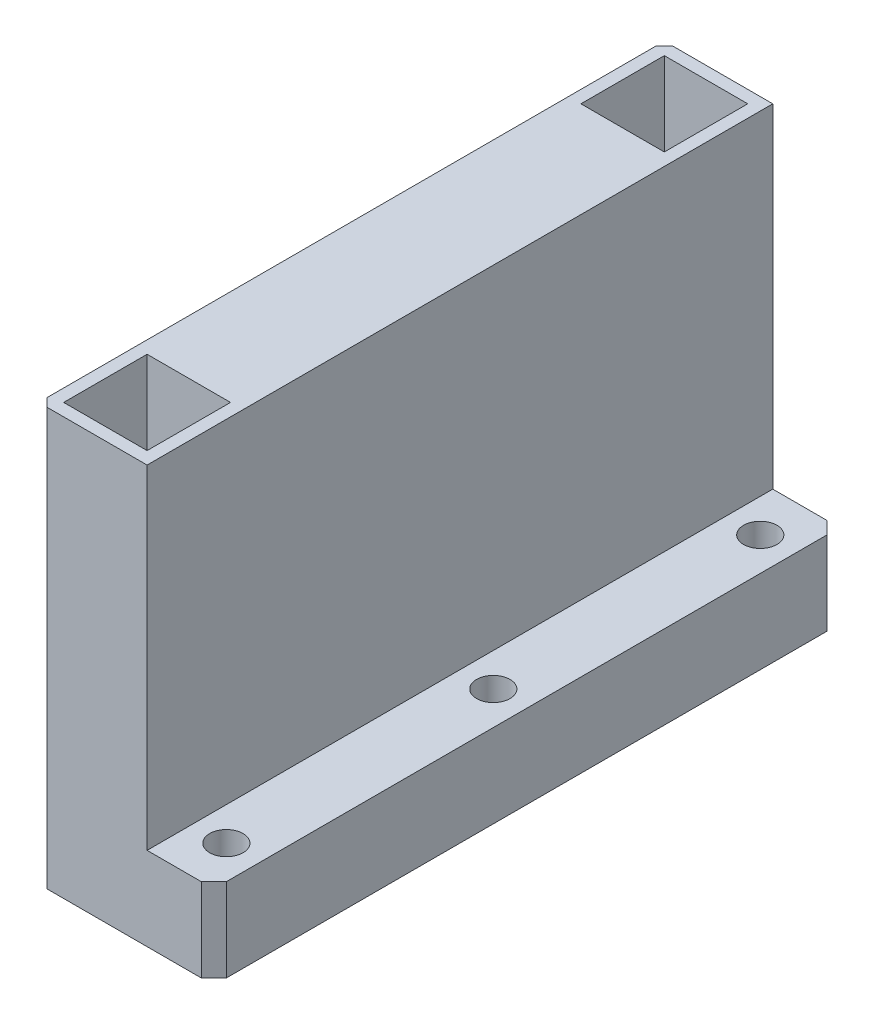
ISO-10303-21;
HEADER;
FILE_DESCRIPTION(('STEP AP214'),'2;1');
FILE_NAME('part.step','',(''),(''),'','','');
FILE_SCHEMA(('AUTOMOTIVE_DESIGN { 1 0 10303 214 1 1 1 1 }'));
ENDSEC;
DATA;
#1=APPLICATION_CONTEXT('core data for automotive mechanical design processes');
#2=APPLICATION_PROTOCOL_DEFINITION('international standard','automotive_design',2000,#1);
#3=PRODUCT_CONTEXT('',#1,'mechanical');
#4=PRODUCT('Part','Part','',(#3));
#5=PRODUCT_RELATED_PRODUCT_CATEGORY('part','',(#4));
#6=PRODUCT_DEFINITION_FORMATION('','',#4);
#7=PRODUCT_DEFINITION_CONTEXT('part definition',#1,'design');
#8=PRODUCT_DEFINITION('design','',#6,#7);
#9=PRODUCT_DEFINITION_SHAPE('','',#8);
#10=(LENGTH_UNIT() NAMED_UNIT(*) SI_UNIT(.MILLI.,.METRE.));
#11=(NAMED_UNIT(*) PLANE_ANGLE_UNIT() SI_UNIT($,.RADIAN.));
#12=(NAMED_UNIT(*) SI_UNIT($,.STERADIAN.) SOLID_ANGLE_UNIT());
#13=UNCERTAINTY_MEASURE_WITH_UNIT(LENGTH_MEASURE(1.E-05),#10,'distance_accuracy_value','');
#14=(GEOMETRIC_REPRESENTATION_CONTEXT(3) GLOBAL_UNCERTAINTY_ASSIGNED_CONTEXT((#13)) GLOBAL_UNIT_ASSIGNED_CONTEXT((#10,
#11,#12)) REPRESENTATION_CONTEXT('',''));
#15=CARTESIAN_POINT('',(0.,0.,0.));
#16=DIRECTION('',(0.,0.,1.));
#17=DIRECTION('',(1.,0.,0.));
#18=AXIS2_PLACEMENT_3D('',#15,#16,#17);
#19=CARTESIAN_POINT('',(0.,50.,75.));
#20=DIRECTION('',(0.,-1.,0.));
#21=DIRECTION('',(0.,0.,-1.));
#22=AXIS2_PLACEMENT_3D('',#19,#20,#21);
#23=PLANE('',#22);
#24=DIRECTION('',(0.,0.,1.));
#25=VECTOR('',#24,1.);
#26=CARTESIAN_POINT('',(11.5,50.,0.));
#27=LINE('',#26,#25);
#28=CARTESIAN_POINT('',(11.5,50.,63.5));
#29=VERTEX_POINT('',#28);
#30=CARTESIAN_POINT('',(11.5,50.,73.5));
#31=VERTEX_POINT('',#30);
#32=EDGE_CURVE('E224',#29,#31,#27,.T.);
#33=ORIENTED_EDGE('',*,*,#32,.T.);
#34=DIRECTION('',(1.,0.,0.));
#35=VECTOR('',#34,1.);
#36=CARTESIAN_POINT('',(0.,50.,73.5));
#37=LINE('',#36,#35);
#38=CARTESIAN_POINT('',(1.50000000000001,50.,73.5));
#39=VERTEX_POINT('',#38);
#40=EDGE_CURVE('E215',#39,#31,#37,.T.);
#41=ORIENTED_EDGE('',*,*,#40,.F.);
#42=DIRECTION('',(0.,0.,1.));
#43=VECTOR('',#42,1.);
#44=CARTESIAN_POINT('',(1.5,50.,0.));
#45=LINE('',#44,#43);
#46=CARTESIAN_POINT('',(1.50000000000001,50.,63.5));
#47=VERTEX_POINT('',#46);
#48=EDGE_CURVE('E231',#47,#39,#45,.T.);
#49=ORIENTED_EDGE('',*,*,#48,.F.);
#50=DIRECTION('',(1.,0.,0.));
#51=VECTOR('',#50,1.);
#52=CARTESIAN_POINT('',(0.,50.,63.5));
#53=LINE('',#52,#51);
#54=EDGE_CURVE('E227',#47,#29,#53,.T.);
#55=ORIENTED_EDGE('',*,*,#54,.T.);
#56=EDGE_LOOP('',(#33,#41,#49,#55));
#57=FACE_BOUND('',#56,.T.);
#58=DIRECTION('',(-1.,0.,0.));
#59=VECTOR('',#58,1.);
#60=CARTESIAN_POINT('',(0.,50.,0.));
#61=LINE('',#60,#59);
#62=CARTESIAN_POINT('',(13.,50.,0.));
#63=VERTEX_POINT('',#62);
#64=CARTESIAN_POINT('',(1.,50.,0.));
#65=VERTEX_POINT('',#64);
#66=EDGE_CURVE('E246',#63,#65,#61,.T.);
#67=ORIENTED_EDGE('',*,*,#66,.T.);
#68=DIRECTION('',(-0.707106781186552,0.,0.707106781186543));
#69=VECTOR('',#68,1.);
#70=CARTESIAN_POINT('',(0.,50.,0.999999999999987));
#71=LINE('',#70,#69);
#72=CARTESIAN_POINT('',(0.,50.,0.999999999999987));
#73=VERTEX_POINT('',#72);
#74=EDGE_CURVE('E44',#65,#73,#71,.T.);
#75=ORIENTED_EDGE('',*,*,#74,.T.);
#76=DIRECTION('',(0.,0.,-1.));
#77=VECTOR('',#76,1.);
#78=CARTESIAN_POINT('',(0.,50.,75.));
#79=LINE('',#78,#77);
#80=CARTESIAN_POINT('',(0.,50.,74.));
#81=VERTEX_POINT('',#80);
#82=EDGE_CURVE('E252',#81,#73,#79,.T.);
#83=ORIENTED_EDGE('',*,*,#82,.F.);
#84=DIRECTION('',(-0.707106781186543,0.,-0.707106781186552));
#85=VECTOR('',#84,1.);
#86=CARTESIAN_POINT('',(0.999999999999987,50.,75.));
#87=LINE('',#86,#85);
#88=CARTESIAN_POINT('',(0.999999999999987,50.,75.));
#89=VERTEX_POINT('',#88);
#90=EDGE_CURVE('E51',#81,#89,#87,.F.);
#91=ORIENTED_EDGE('',*,*,#90,.T.);
#92=DIRECTION('',(-1.,0.,0.));
#93=VECTOR('',#92,1.);
#94=CARTESIAN_POINT('',(0.,50.,75.));
#95=LINE('',#94,#93);
#96=CARTESIAN_POINT('',(13.,50.,75.));
#97=VERTEX_POINT('',#96);
#98=EDGE_CURVE('E250',#97,#89,#95,.T.);
#99=ORIENTED_EDGE('',*,*,#98,.F.);
#100=DIRECTION('',(0.,0.,-1.));
#101=VECTOR('',#100,1.);
#102=CARTESIAN_POINT('',(13.,50.,75.));
#103=LINE('',#102,#101);
#104=EDGE_CURVE('E261',#97,#63,#103,.T.);
#105=ORIENTED_EDGE('',*,*,#104,.T.);
#106=EDGE_LOOP('',(#67,#75,#83,#91,#99,#105));
#107=FACE_BOUND('',#106,.T.);
#108=DIRECTION('',(0.,0.,1.));
#109=VECTOR('',#108,1.);
#110=CARTESIAN_POINT('',(11.5,50.,0.));
#111=LINE('',#110,#109);
#112=CARTESIAN_POINT('',(11.5,50.,1.5));
#113=VERTEX_POINT('',#112);
#114=CARTESIAN_POINT('',(11.5,50.,11.5));
#115=VERTEX_POINT('',#114);
#116=EDGE_CURVE('E183',#113,#115,#111,.T.);
#117=ORIENTED_EDGE('',*,*,#116,.T.);
#118=DIRECTION('',(1.,0.,0.));
#119=VECTOR('',#118,1.);
#120=CARTESIAN_POINT('',(0.,50.,11.5));
#121=LINE('',#120,#119);
#122=CARTESIAN_POINT('',(1.5,50.,11.5));
#123=VERTEX_POINT('',#122);
#124=EDGE_CURVE('E189',#123,#115,#121,.T.);
#125=ORIENTED_EDGE('',*,*,#124,.F.);
#126=DIRECTION('',(0.,0.,1.));
#127=VECTOR('',#126,1.);
#128=CARTESIAN_POINT('',(1.5,50.,0.));
#129=LINE('',#128,#127);
#130=CARTESIAN_POINT('',(1.5,50.,1.5));
#131=VERTEX_POINT('',#130);
#132=EDGE_CURVE('E192',#131,#123,#129,.T.);
#133=ORIENTED_EDGE('',*,*,#132,.F.);
#134=DIRECTION('',(1.,0.,0.));
#135=VECTOR('',#134,1.);
#136=CARTESIAN_POINT('',(0.,50.,1.5));
#137=LINE('',#136,#135);
#138=EDGE_CURVE('E201',#131,#113,#137,.T.);
#139=ORIENTED_EDGE('',*,*,#138,.T.);
#140=EDGE_LOOP('',(#117,#125,#133,#139));
#141=FACE_BOUND('',#140,.T.);
#142=ADVANCED_FACE('F35',(#57,#107,#141),#23,.F.);
#143=CARTESIAN_POINT('',(0.,0.,75.));
#144=DIRECTION('',(1.,0.,0.));
#145=DIRECTION('',(0.,0.,-1.));
#146=AXIS2_PLACEMENT_3D('',#143,#144,#145);
#147=PLANE('',#146);
#148=ORIENTED_EDGE('',*,*,#82,.T.);
#149=DIRECTION('',(0.,-1.,0.));
#150=VECTOR('',#149,1.);
#151=CARTESIAN_POINT('',(0.,0.,0.999999999999987));
#152=LINE('',#151,#150);
#153=CARTESIAN_POINT('',(0.,0.,0.999999999999987));
#154=VERTEX_POINT('',#153);
#155=EDGE_CURVE('E298',#73,#154,#152,.T.);
#156=ORIENTED_EDGE('',*,*,#155,.T.);
#157=DIRECTION('',(0.,0.,-1.));
#158=VECTOR('',#157,1.);
#159=CARTESIAN_POINT('',(0.,0.,75.));
#160=LINE('',#159,#158);
#161=CARTESIAN_POINT('',(0.,0.,74.));
#162=VERTEX_POINT('',#161);
#163=EDGE_CURVE('E273',#162,#154,#160,.T.);
#164=ORIENTED_EDGE('',*,*,#163,.F.);
#165=DIRECTION('',(0.,1.,0.));
#166=VECTOR('',#165,1.);
#167=CARTESIAN_POINT('',(0.,0.,74.));
#168=LINE('',#167,#166);
#169=EDGE_CURVE('E296',#162,#81,#168,.T.);
#170=ORIENTED_EDGE('',*,*,#169,.T.);
#171=EDGE_LOOP('',(#148,#156,#164,#170));
#172=FACE_BOUND('',#171,.T.);
#173=ADVANCED_FACE('F311',(#172),#147,.F.);
#174=CARTESIAN_POINT('',(0.,0.,75.));
#175=DIRECTION('',(0.,1.,0.));
#176=DIRECTION('',(0.,0.,1.));
#177=AXIS2_PLACEMENT_3D('',#174,#175,#176);
#178=PLANE('',#177);
#179=CARTESIAN_POINT('',(17.,0.,69.5));
#180=DIRECTION('',(0.,1.,0.));
#181=DIRECTION('',(0.,0.,1.));
#182=AXIS2_PLACEMENT_3D('',#179,#180,#181);
#183=CIRCLE('',#182,2.);
#184=CARTESIAN_POINT('',(17.,0.,71.5));
#185=VERTEX_POINT('',#184);
#186=EDGE_CURVE('E228',#185,#185,#183,.T.);
#187=ORIENTED_EDGE('',*,*,#186,.T.);
#188=EDGE_LOOP('',(#187));
#189=FACE_BOUND('',#188,.T.);
#190=CARTESIAN_POINT('',(17.,0.,37.5));
#191=DIRECTION('',(0.,1.,0.));
#192=DIRECTION('',(0.,0.,1.));
#193=AXIS2_PLACEMENT_3D('',#190,#191,#192);
#194=CIRCLE('',#193,2.);
#195=CARTESIAN_POINT('',(17.,0.,39.5));
#196=VERTEX_POINT('',#195);
#197=EDGE_CURVE('E581',#196,#196,#194,.T.);
#198=ORIENTED_EDGE('',*,*,#197,.T.);
#199=EDGE_LOOP('',(#198));
#200=FACE_BOUND('',#199,.T.);
#201=CARTESIAN_POINT('',(17.,0.,5.5));
#202=DIRECTION('',(0.,1.,0.));
#203=DIRECTION('',(0.,0.,1.));
#204=AXIS2_PLACEMENT_3D('',#201,#202,#203);
#205=CIRCLE('',#204,2.);
#206=CARTESIAN_POINT('',(17.,0.,7.5));
#207=VERTEX_POINT('',#206);
#208=EDGE_CURVE('E589',#207,#207,#205,.T.);
#209=ORIENTED_EDGE('',*,*,#208,.T.);
#210=EDGE_LOOP('',(#209));
#211=FACE_BOUND('',#210,.T.);
#212=ORIENTED_EDGE('',*,*,#163,.T.);
#213=DIRECTION('',(0.707106781186552,0.,-0.707106781186543));
#214=VECTOR('',#213,1.);
#215=CARTESIAN_POINT('',(0.,0.,0.999999999999987));
#216=LINE('',#215,#214);
#217=CARTESIAN_POINT('',(1.,0.,0.));
#218=VERTEX_POINT('',#217);
#219=EDGE_CURVE('E303',#154,#218,#216,.T.);
#220=ORIENTED_EDGE('',*,*,#219,.T.);
#221=DIRECTION('',(1.,0.,0.));
#222=VECTOR('',#221,1.);
#223=CARTESIAN_POINT('',(0.,0.,0.));
#224=LINE('',#223,#222);
#225=CARTESIAN_POINT('',(19.5,0.,0.));
#226=VERTEX_POINT('',#225);
#227=EDGE_CURVE('E208',#218,#226,#224,.T.);
#228=ORIENTED_EDGE('',*,*,#227,.T.);
#229=DIRECTION('',(0.707106781186551,0.,0.707106781186544));
#230=VECTOR('',#229,1.);
#231=CARTESIAN_POINT('',(21.,0.,1.49999999999999));
#232=LINE('',#231,#230);
#233=CARTESIAN_POINT('',(21.,0.,1.49999999999999));
#234=VERTEX_POINT('',#233);
#235=EDGE_CURVE('E291',#226,#234,#232,.T.);
#236=ORIENTED_EDGE('',*,*,#235,.T.);
#237=DIRECTION('',(0.,0.,-1.));
#238=VECTOR('',#237,1.);
#239=CARTESIAN_POINT('',(21.,0.,75.));
#240=LINE('',#239,#238);
#241=CARTESIAN_POINT('',(21.,0.,73.5));
#242=VERTEX_POINT('',#241);
#243=EDGE_CURVE('E270',#242,#234,#240,.T.);
#244=ORIENTED_EDGE('',*,*,#243,.F.);
#245=DIRECTION('',(0.707106781186548,0.,-0.707106781186548));
#246=VECTOR('',#245,1.);
#247=CARTESIAN_POINT('',(19.5,0.,75.));
#248=LINE('',#247,#246);
#249=CARTESIAN_POINT('',(19.5,0.,75.));
#250=VERTEX_POINT('',#249);
#251=EDGE_CURVE('E288',#242,#250,#248,.F.);
#252=ORIENTED_EDGE('',*,*,#251,.T.);
#253=DIRECTION('',(1.,0.,0.));
#254=VECTOR('',#253,1.);
#255=CARTESIAN_POINT('',(0.,0.,75.));
#256=LINE('',#255,#254);
#257=CARTESIAN_POINT('',(0.999999999999987,0.,75.));
#258=VERTEX_POINT('',#257);
#259=EDGE_CURVE('E243',#258,#250,#256,.T.);
#260=ORIENTED_EDGE('',*,*,#259,.F.);
#261=DIRECTION('',(0.707106781186543,0.,0.707106781186552));
#262=VECTOR('',#261,1.);
#263=CARTESIAN_POINT('',(0.999999999999987,0.,75.));
#264=LINE('',#263,#262);
#265=EDGE_CURVE('E301',#258,#162,#264,.F.);
#266=ORIENTED_EDGE('',*,*,#265,.T.);
#267=EDGE_LOOP('',(#212,#220,#228,#236,#244,#252,#260,#266));
#268=FACE_BOUND('',#267,.T.);
#269=ADVANCED_FACE('F316',(#189,#200,#211,#268),#178,.F.);
#270=CARTESIAN_POINT('',(21.,0.,75.));
#271=DIRECTION('',(-1.,0.,0.));
#272=DIRECTION('',(0.,0.,1.));
#273=AXIS2_PLACEMENT_3D('',#270,#271,#272);
#274=PLANE('',#273);
#275=ORIENTED_EDGE('',*,*,#243,.T.);
#276=DIRECTION('',(0.,1.,0.));
#277=VECTOR('',#276,1.);
#278=CARTESIAN_POINT('',(21.,10.,1.49999999999999));
#279=LINE('',#278,#277);
#280=CARTESIAN_POINT('',(21.,10.,1.49999999999999));
#281=VERTEX_POINT('',#280);
#282=EDGE_CURVE('E278',#234,#281,#279,.T.);
#283=ORIENTED_EDGE('',*,*,#282,.T.);
#284=DIRECTION('',(0.,0.,-1.));
#285=VECTOR('',#284,1.);
#286=CARTESIAN_POINT('',(21.,10.,75.));
#287=LINE('',#286,#285);
#288=CARTESIAN_POINT('',(21.,10.,73.5));
#289=VERTEX_POINT('',#288);
#290=EDGE_CURVE('E267',#289,#281,#287,.T.);
#291=ORIENTED_EDGE('',*,*,#290,.F.);
#292=DIRECTION('',(0.,-1.,0.));
#293=VECTOR('',#292,1.);
#294=CARTESIAN_POINT('',(21.,0.,73.5));
#295=LINE('',#294,#293);
#296=EDGE_CURVE('E276',#289,#242,#295,.T.);
#297=ORIENTED_EDGE('',*,*,#296,.T.);
#298=EDGE_LOOP('',(#275,#283,#291,#297));
#299=FACE_BOUND('',#298,.T.);
#300=ADVANCED_FACE('F328',(#299),#274,.F.);
#301=CARTESIAN_POINT('',(13.,10.,75.));
#302=DIRECTION('',(0.,-1.,0.));
#303=DIRECTION('',(0.,0.,-1.));
#304=AXIS2_PLACEMENT_3D('',#301,#302,#303);
#305=PLANE('',#304);
#306=CARTESIAN_POINT('',(17.,10.,69.5));
#307=DIRECTION('',(0.,1.,0.));
#308=DIRECTION('',(0.,0.,1.));
#309=AXIS2_PLACEMENT_3D('',#306,#307,#308);
#310=CIRCLE('',#309,2.);
#311=CARTESIAN_POINT('',(17.,10.,71.5));
#312=VERTEX_POINT('',#311);
#313=EDGE_CURVE('E580',#312,#312,#310,.T.);
#314=ORIENTED_EDGE('',*,*,#313,.F.);
#315=EDGE_LOOP('',(#314));
#316=FACE_BOUND('',#315,.T.);
#317=CARTESIAN_POINT('',(17.,10.,37.5));
#318=DIRECTION('',(0.,1.,0.));
#319=DIRECTION('',(0.,0.,1.));
#320=AXIS2_PLACEMENT_3D('',#317,#318,#319);
#321=CIRCLE('',#320,2.);
#322=CARTESIAN_POINT('',(17.,10.,39.5));
#323=VERTEX_POINT('',#322);
#324=EDGE_CURVE('E585',#323,#323,#321,.T.);
#325=ORIENTED_EDGE('',*,*,#324,.F.);
#326=EDGE_LOOP('',(#325));
#327=FACE_BOUND('',#326,.T.);
#328=CARTESIAN_POINT('',(17.,10.,5.5));
#329=DIRECTION('',(0.,1.,0.));
#330=DIRECTION('',(0.,0.,1.));
#331=AXIS2_PLACEMENT_3D('',#328,#329,#330);
#332=CIRCLE('',#331,2.);
#333=CARTESIAN_POINT('',(17.,10.,7.5));
#334=VERTEX_POINT('',#333);
#335=EDGE_CURVE('E195',#334,#334,#332,.T.);
#336=ORIENTED_EDGE('',*,*,#335,.F.);
#337=EDGE_LOOP('',(#336));
#338=FACE_BOUND('',#337,.T.);
#339=ORIENTED_EDGE('',*,*,#290,.T.);
#340=DIRECTION('',(-0.707106781186551,0.,-0.707106781186544));
#341=VECTOR('',#340,1.);
#342=CARTESIAN_POINT('',(21.,10.,1.49999999999999));
#343=LINE('',#342,#341);
#344=CARTESIAN_POINT('',(19.5,10.,0.));
#345=VERTEX_POINT('',#344);
#346=EDGE_CURVE('E283',#281,#345,#343,.T.);
#347=ORIENTED_EDGE('',*,*,#346,.T.);
#348=DIRECTION('',(-1.,0.,0.));
#349=VECTOR('',#348,1.);
#350=CARTESIAN_POINT('',(13.,10.,0.));
#351=LINE('',#350,#349);
#352=CARTESIAN_POINT('',(13.,10.,0.));
#353=VERTEX_POINT('',#352);
#354=EDGE_CURVE('E254',#345,#353,#351,.T.);
#355=ORIENTED_EDGE('',*,*,#354,.T.);
#356=DIRECTION('',(0.,0.,-1.));
#357=VECTOR('',#356,1.);
#358=CARTESIAN_POINT('',(13.,10.,75.));
#359=LINE('',#358,#357);
#360=CARTESIAN_POINT('',(13.,10.,75.));
#361=VERTEX_POINT('',#360);
#362=EDGE_CURVE('E264',#361,#353,#359,.T.);
#363=ORIENTED_EDGE('',*,*,#362,.F.);
#364=DIRECTION('',(-1.,0.,0.));
#365=VECTOR('',#364,1.);
#366=CARTESIAN_POINT('',(13.,10.,75.));
#367=LINE('',#366,#365);
#368=CARTESIAN_POINT('',(19.5,10.,75.));
#369=VERTEX_POINT('',#368);
#370=EDGE_CURVE('E245',#369,#361,#367,.T.);
#371=ORIENTED_EDGE('',*,*,#370,.F.);
#372=DIRECTION('',(-0.707106781186548,0.,0.707106781186548));
#373=VECTOR('',#372,1.);
#374=CARTESIAN_POINT('',(19.5,10.,75.));
#375=LINE('',#374,#373);
#376=EDGE_CURVE('E281',#369,#289,#375,.F.);
#377=ORIENTED_EDGE('',*,*,#376,.T.);
#378=EDGE_LOOP('',(#339,#347,#355,#363,#371,#377));
#379=FACE_BOUND('',#378,.T.);
#380=ADVANCED_FACE('F357',(#316,#327,#338,#379),#305,.F.);
#381=CARTESIAN_POINT('',(13.,50.,75.));
#382=DIRECTION('',(-1.,0.,0.));
#383=DIRECTION('',(0.,-1.,0.));
#384=AXIS2_PLACEMENT_3D('',#381,#382,#383);
#385=PLANE('',#384);
#386=DIRECTION('',(0.,1.,0.));
#387=VECTOR('',#386,1.);
#388=CARTESIAN_POINT('',(13.,50.,0.));
#389=LINE('',#388,#387);
#390=EDGE_CURVE('E256',#353,#63,#389,.T.);
#391=ORIENTED_EDGE('',*,*,#390,.T.);
#392=ORIENTED_EDGE('',*,*,#104,.F.);
#393=DIRECTION('',(0.,1.,0.));
#394=VECTOR('',#393,1.);
#395=CARTESIAN_POINT('',(13.,50.,75.));
#396=LINE('',#395,#394);
#397=EDGE_CURVE('E248',#361,#97,#396,.T.);
#398=ORIENTED_EDGE('',*,*,#397,.F.);
#399=ORIENTED_EDGE('',*,*,#362,.T.);
#400=EDGE_LOOP('',(#391,#392,#398,#399));
#401=FACE_BOUND('',#400,.T.);
#402=ADVANCED_FACE('F354',(#401),#385,.F.);
#403=CARTESIAN_POINT('',(0.,0.,75.));
#404=DIRECTION('',(0.,0.,-1.));
#405=DIRECTION('',(-1.,0.,0.));
#406=AXIS2_PLACEMENT_3D('',#403,#404,#405);
#407=PLANE('',#406);
#408=ORIENTED_EDGE('',*,*,#98,.T.);
#409=DIRECTION('',(0.,-1.,0.));
#410=VECTOR('',#409,1.);
#411=CARTESIAN_POINT('',(0.999999999999987,0.,75.));
#412=LINE('',#411,#410);
#413=EDGE_CURVE('E11',#89,#258,#412,.T.);
#414=ORIENTED_EDGE('',*,*,#413,.T.);
#415=ORIENTED_EDGE('',*,*,#259,.T.);
#416=DIRECTION('',(0.,1.,0.));
#417=VECTOR('',#416,1.);
#418=CARTESIAN_POINT('',(19.5,0.,75.));
#419=LINE('',#418,#417);
#420=EDGE_CURVE('E293',#250,#369,#419,.T.);
#421=ORIENTED_EDGE('',*,*,#420,.T.);
#422=ORIENTED_EDGE('',*,*,#370,.T.);
#423=ORIENTED_EDGE('',*,*,#397,.T.);
#424=EDGE_LOOP('',(#408,#414,#415,#421,#422,#423));
#425=FACE_BOUND('',#424,.T.);
#426=ADVANCED_FACE('F336',(#425),#407,.F.);
#427=CARTESIAN_POINT('',(0.,0.,0.));
#428=DIRECTION('',(0.,0.,-1.));
#429=DIRECTION('',(-1.,0.,0.));
#430=AXIS2_PLACEMENT_3D('',#427,#428,#429);
#431=PLANE('',#430);
#432=ORIENTED_EDGE('',*,*,#227,.F.);
#433=DIRECTION('',(0.,1.,0.));
#434=VECTOR('',#433,1.);
#435=CARTESIAN_POINT('',(1.,50.,0.));
#436=LINE('',#435,#434);
#437=EDGE_CURVE('E59',#218,#65,#436,.T.);
#438=ORIENTED_EDGE('',*,*,#437,.T.);
#439=ORIENTED_EDGE('',*,*,#66,.F.);
#440=ORIENTED_EDGE('',*,*,#390,.F.);
#441=ORIENTED_EDGE('',*,*,#354,.F.);
#442=DIRECTION('',(0.,-1.,0.));
#443=VECTOR('',#442,1.);
#444=CARTESIAN_POINT('',(19.5,0.,0.));
#445=LINE('',#444,#443);
#446=EDGE_CURVE('E285',#345,#226,#445,.T.);
#447=ORIENTED_EDGE('',*,*,#446,.T.);
#448=EDGE_LOOP('',(#432,#438,#439,#440,#441,#447));
#449=FACE_BOUND('',#448,.T.);
#450=ADVANCED_FACE('F317',(#449),#431,.T.);
#451=CARTESIAN_POINT('',(11.5,40.,0.));
#452=DIRECTION('',(-1.,0.,0.));
#453=DIRECTION('',(0.,0.,1.));
#454=AXIS2_PLACEMENT_3D('',#451,#452,#453);
#455=PLANE('',#454);
#456=ORIENTED_EDGE('',*,*,#32,.F.);
#457=DIRECTION('',(0.,1.,0.));
#458=VECTOR('',#457,1.);
#459=CARTESIAN_POINT('',(11.5,40.,63.5));
#460=LINE('',#459,#458);
#461=CARTESIAN_POINT('',(11.5,40.,63.5));
#462=VERTEX_POINT('',#461);
#463=EDGE_CURVE('E223',#462,#29,#460,.T.);
#464=ORIENTED_EDGE('',*,*,#463,.F.);
#465=DIRECTION('',(0.,0.,1.));
#466=VECTOR('',#465,1.);
#467=CARTESIAN_POINT('',(11.5,40.,0.));
#468=LINE('',#467,#466);
#469=CARTESIAN_POINT('',(11.5,40.,73.5));
#470=VERTEX_POINT('',#469);
#471=EDGE_CURVE('E212',#462,#470,#468,.T.);
#472=ORIENTED_EDGE('',*,*,#471,.T.);
#473=DIRECTION('',(0.,1.,0.));
#474=VECTOR('',#473,1.);
#475=CARTESIAN_POINT('',(11.5,40.,73.5));
#476=LINE('',#475,#474);
#477=EDGE_CURVE('E202',#470,#31,#476,.T.);
#478=ORIENTED_EDGE('',*,*,#477,.T.);
#479=EDGE_LOOP('',(#456,#464,#472,#478));
#480=FACE_BOUND('',#479,.T.);
#481=ADVANCED_FACE('F404',(#480),#455,.T.);
#482=CARTESIAN_POINT('',(0.,40.,73.5));
#483=DIRECTION('',(0.,0.,1.));
#484=DIRECTION('',(1.,0.,0.));
#485=AXIS2_PLACEMENT_3D('',#482,#483,#484);
#486=PLANE('',#485);
#487=ORIENTED_EDGE('',*,*,#40,.T.);
#488=ORIENTED_EDGE('',*,*,#477,.F.);
#489=DIRECTION('',(1.,0.,0.));
#490=VECTOR('',#489,1.);
#491=CARTESIAN_POINT('',(0.,40.,73.5));
#492=LINE('',#491,#490);
#493=CARTESIAN_POINT('',(1.50000000000001,40.,73.5));
#494=VERTEX_POINT('',#493);
#495=EDGE_CURVE('E220',#494,#470,#492,.T.);
#496=ORIENTED_EDGE('',*,*,#495,.F.);
#497=DIRECTION('',(0.,1.,0.));
#498=VECTOR('',#497,1.);
#499=CARTESIAN_POINT('',(1.50000000000001,40.,73.5));
#500=LINE('',#499,#498);
#501=EDGE_CURVE('E237',#494,#39,#500,.T.);
#502=ORIENTED_EDGE('',*,*,#501,.T.);
#503=EDGE_LOOP('',(#487,#488,#496,#502));
#504=FACE_BOUND('',#503,.T.);
#505=ADVANCED_FACE('F438',(#504),#486,.F.);
#506=CARTESIAN_POINT('',(1.5,40.,0.));
#507=DIRECTION('',(-1.,0.,0.));
#508=DIRECTION('',(0.,0.,1.));
#509=AXIS2_PLACEMENT_3D('',#506,#507,#508);
#510=PLANE('',#509);
#511=ORIENTED_EDGE('',*,*,#48,.T.);
#512=ORIENTED_EDGE('',*,*,#501,.F.);
#513=DIRECTION('',(0.,0.,1.));
#514=VECTOR('',#513,1.);
#515=CARTESIAN_POINT('',(1.5,40.,0.));
#516=LINE('',#515,#514);
#517=CARTESIAN_POINT('',(1.50000000000001,40.,63.5));
#518=VERTEX_POINT('',#517);
#519=EDGE_CURVE('E217',#518,#494,#516,.T.);
#520=ORIENTED_EDGE('',*,*,#519,.F.);
#521=DIRECTION('',(0.,1.,0.));
#522=VECTOR('',#521,1.);
#523=CARTESIAN_POINT('',(1.50000000000001,40.,63.5));
#524=LINE('',#523,#522);
#525=EDGE_CURVE('E239',#518,#47,#524,.T.);
#526=ORIENTED_EDGE('',*,*,#525,.T.);
#527=EDGE_LOOP('',(#511,#512,#520,#526));
#528=FACE_BOUND('',#527,.T.);
#529=ADVANCED_FACE('F448',(#528),#510,.F.);
#530=CARTESIAN_POINT('',(0.,40.,63.5));
#531=DIRECTION('',(0.,0.,1.));
#532=DIRECTION('',(1.,0.,0.));
#533=AXIS2_PLACEMENT_3D('',#530,#531,#532);
#534=PLANE('',#533);
#535=ORIENTED_EDGE('',*,*,#54,.F.);
#536=ORIENTED_EDGE('',*,*,#525,.F.);
#537=DIRECTION('',(1.,0.,0.));
#538=VECTOR('',#537,1.);
#539=CARTESIAN_POINT('',(0.,40.,63.5));
#540=LINE('',#539,#538);
#541=EDGE_CURVE('E214',#518,#462,#540,.T.);
#542=ORIENTED_EDGE('',*,*,#541,.T.);
#543=ORIENTED_EDGE('',*,*,#463,.T.);
#544=EDGE_LOOP('',(#535,#536,#542,#543));
#545=FACE_BOUND('',#544,.T.);
#546=ADVANCED_FACE('F457',(#545),#534,.T.);
#547=CARTESIAN_POINT('',(0.,40.,0.));
#548=DIRECTION('',(0.,1.,0.));
#549=DIRECTION('',(0.,0.,1.));
#550=AXIS2_PLACEMENT_3D('',#547,#548,#549);
#551=PLANE('',#550);
#552=ORIENTED_EDGE('',*,*,#471,.F.);
#553=ORIENTED_EDGE('',*,*,#541,.F.);
#554=ORIENTED_EDGE('',*,*,#519,.T.);
#555=ORIENTED_EDGE('',*,*,#495,.T.);
#556=EDGE_LOOP('',(#552,#553,#554,#555));
#557=FACE_BOUND('',#556,.T.);
#558=ADVANCED_FACE('F466',(#557),#551,.T.);
#559=CARTESIAN_POINT('',(11.5,40.,0.));
#560=DIRECTION('',(-1.,0.,0.));
#561=DIRECTION('',(0.,0.,1.));
#562=AXIS2_PLACEMENT_3D('',#559,#560,#561);
#563=PLANE('',#562);
#564=ORIENTED_EDGE('',*,*,#116,.F.);
#565=DIRECTION('',(0.,1.,0.));
#566=VECTOR('',#565,1.);
#567=CARTESIAN_POINT('',(11.5,40.,1.5));
#568=LINE('',#567,#566);
#569=CARTESIAN_POINT('',(11.5,40.,1.5));
#570=VERTEX_POINT('',#569);
#571=EDGE_CURVE('E169',#570,#113,#568,.T.);
#572=ORIENTED_EDGE('',*,*,#571,.F.);
#573=DIRECTION('',(0.,0.,1.));
#574=VECTOR('',#573,1.);
#575=CARTESIAN_POINT('',(11.5,40.,0.));
#576=LINE('',#575,#574);
#577=CARTESIAN_POINT('',(11.5,40.,11.5));
#578=VERTEX_POINT('',#577);
#579=EDGE_CURVE('E177',#570,#578,#576,.T.);
#580=ORIENTED_EDGE('',*,*,#579,.T.);
#581=DIRECTION('',(0.,1.,0.));
#582=VECTOR('',#581,1.);
#583=CARTESIAN_POINT('',(11.5,40.,11.5));
#584=LINE('',#583,#582);
#585=EDGE_CURVE('E206',#578,#115,#584,.T.);
#586=ORIENTED_EDGE('',*,*,#585,.T.);
#587=EDGE_LOOP('',(#564,#572,#580,#586));
#588=FACE_BOUND('',#587,.T.);
#589=ADVANCED_FACE('F180',(#588),#563,.T.);
#590=CARTESIAN_POINT('',(0.,40.,11.5));
#591=DIRECTION('',(0.,0.,1.));
#592=DIRECTION('',(1.,0.,0.));
#593=AXIS2_PLACEMENT_3D('',#590,#591,#592);
#594=PLANE('',#593);
#595=ORIENTED_EDGE('',*,*,#124,.T.);
#596=ORIENTED_EDGE('',*,*,#585,.F.);
#597=DIRECTION('',(1.,0.,0.));
#598=VECTOR('',#597,1.);
#599=CARTESIAN_POINT('',(0.,40.,11.5));
#600=LINE('',#599,#598);
#601=CARTESIAN_POINT('',(1.5,40.,11.5));
#602=VERTEX_POINT('',#601);
#603=EDGE_CURVE('E184',#602,#578,#600,.T.);
#604=ORIENTED_EDGE('',*,*,#603,.F.);
#605=DIRECTION('',(0.,1.,0.));
#606=VECTOR('',#605,1.);
#607=CARTESIAN_POINT('',(1.5,40.,11.5));
#608=LINE('',#607,#606);
#609=EDGE_CURVE('E209',#602,#123,#608,.T.);
#610=ORIENTED_EDGE('',*,*,#609,.T.);
#611=EDGE_LOOP('',(#595,#596,#604,#610));
#612=FACE_BOUND('',#611,.T.);
#613=ADVANCED_FACE('F483',(#612),#594,.F.);
#614=CARTESIAN_POINT('',(1.5,40.,0.));
#615=DIRECTION('',(-1.,0.,0.));
#616=DIRECTION('',(0.,0.,1.));
#617=AXIS2_PLACEMENT_3D('',#614,#615,#616);
#618=PLANE('',#617);
#619=ORIENTED_EDGE('',*,*,#132,.T.);
#620=ORIENTED_EDGE('',*,*,#609,.F.);
#621=DIRECTION('',(0.,0.,1.));
#622=VECTOR('',#621,1.);
#623=CARTESIAN_POINT('',(1.5,40.,0.));
#624=LINE('',#623,#622);
#625=CARTESIAN_POINT('',(1.5,40.,1.5));
#626=VERTEX_POINT('',#625);
#627=EDGE_CURVE('E176',#626,#602,#624,.T.);
#628=ORIENTED_EDGE('',*,*,#627,.F.);
#629=DIRECTION('',(0.,1.,0.));
#630=VECTOR('',#629,1.);
#631=CARTESIAN_POINT('',(1.5,40.,1.5));
#632=LINE('',#631,#630);
#633=EDGE_CURVE('E171',#626,#131,#632,.T.);
#634=ORIENTED_EDGE('',*,*,#633,.T.);
#635=EDGE_LOOP('',(#619,#620,#628,#634));
#636=FACE_BOUND('',#635,.T.);
#637=ADVANCED_FACE('F491',(#636),#618,.F.);
#638=CARTESIAN_POINT('',(0.,40.,1.5));
#639=DIRECTION('',(0.,0.,1.));
#640=DIRECTION('',(1.,0.,0.));
#641=AXIS2_PLACEMENT_3D('',#638,#639,#640);
#642=PLANE('',#641);
#643=ORIENTED_EDGE('',*,*,#138,.F.);
#644=ORIENTED_EDGE('',*,*,#633,.F.);
#645=DIRECTION('',(1.,0.,0.));
#646=VECTOR('',#645,1.);
#647=CARTESIAN_POINT('',(0.,40.,1.5));
#648=LINE('',#647,#646);
#649=EDGE_CURVE('E165',#626,#570,#648,.T.);
#650=ORIENTED_EDGE('',*,*,#649,.T.);
#651=ORIENTED_EDGE('',*,*,#571,.T.);
#652=EDGE_LOOP('',(#643,#644,#650,#651));
#653=FACE_BOUND('',#652,.T.);
#654=ADVANCED_FACE('F168',(#653),#642,.T.);
#655=CARTESIAN_POINT('',(0.,40.,0.));
#656=DIRECTION('',(0.,1.,0.));
#657=DIRECTION('',(0.,0.,1.));
#658=AXIS2_PLACEMENT_3D('',#655,#656,#657);
#659=PLANE('',#658);
#660=ORIENTED_EDGE('',*,*,#579,.F.);
#661=ORIENTED_EDGE('',*,*,#649,.F.);
#662=ORIENTED_EDGE('',*,*,#627,.T.);
#663=ORIENTED_EDGE('',*,*,#603,.T.);
#664=EDGE_LOOP('',(#660,#661,#662,#663));
#665=FACE_BOUND('',#664,.T.);
#666=ADVANCED_FACE('F187',(#665),#659,.T.);
#667=CARTESIAN_POINT('',(17.,0.,5.5));
#668=DIRECTION('',(0.,1.,0.));
#669=DIRECTION('',(0.,0.,1.));
#670=AXIS2_PLACEMENT_3D('',#667,#668,#669);
#671=CYLINDRICAL_SURFACE('',#670,2.);
#672=ORIENTED_EDGE('',*,*,#208,.F.);
#673=EDGE_LOOP('',(#672));
#674=FACE_BOUND('',#673,.T.);
#675=ORIENTED_EDGE('',*,*,#335,.T.);
#676=EDGE_LOOP('',(#675));
#677=FACE_BOUND('',#676,.T.);
#678=ADVANCED_FACE('F515',(#674,#677),#671,.F.);
#679=CARTESIAN_POINT('',(17.,0.,37.5));
#680=DIRECTION('',(0.,1.,0.));
#681=DIRECTION('',(0.,0.,1.));
#682=AXIS2_PLACEMENT_3D('',#679,#680,#681);
#683=CYLINDRICAL_SURFACE('',#682,2.);
#684=ORIENTED_EDGE('',*,*,#197,.F.);
#685=EDGE_LOOP('',(#684));
#686=FACE_BOUND('',#685,.T.);
#687=ORIENTED_EDGE('',*,*,#324,.T.);
#688=EDGE_LOOP('',(#687));
#689=FACE_BOUND('',#688,.T.);
#690=ADVANCED_FACE('F523',(#686,#689),#683,.F.);
#691=CARTESIAN_POINT('',(17.,0.,69.5));
#692=DIRECTION('',(0.,1.,0.));
#693=DIRECTION('',(0.,0.,1.));
#694=AXIS2_PLACEMENT_3D('',#691,#692,#693);
#695=CYLINDRICAL_SURFACE('',#694,2.);
#696=ORIENTED_EDGE('',*,*,#186,.F.);
#697=EDGE_LOOP('',(#696));
#698=FACE_BOUND('',#697,.T.);
#699=ORIENTED_EDGE('',*,*,#313,.T.);
#700=EDGE_LOOP('',(#699));
#701=FACE_BOUND('',#700,.T.);
#702=ADVANCED_FACE('F373',(#698,#701),#695,.F.);
#703=CARTESIAN_POINT('',(21.,0.,1.49999999999999));
#704=DIRECTION('',(0.707106781186544,0.,-0.707106781186551));
#705=DIRECTION('',(0.,-1.,0.));
#706=AXIS2_PLACEMENT_3D('',#703,#704,#705);
#707=PLANE('',#706);
#708=ORIENTED_EDGE('',*,*,#235,.F.);
#709=ORIENTED_EDGE('',*,*,#446,.F.);
#710=ORIENTED_EDGE('',*,*,#346,.F.);
#711=ORIENTED_EDGE('',*,*,#282,.F.);
#712=EDGE_LOOP('',(#708,#709,#710,#711));
#713=FACE_BOUND('',#712,.T.);
#714=ADVANCED_FACE('F324',(#713),#707,.T.);
#715=CARTESIAN_POINT('',(19.5,0.,75.));
#716=DIRECTION('',(-0.707106781186547,0.,-0.707106781186547));
#717=DIRECTION('',(0.,1.,0.));
#718=AXIS2_PLACEMENT_3D('',#715,#716,#717);
#719=PLANE('',#718);
#720=ORIENTED_EDGE('',*,*,#251,.F.);
#721=ORIENTED_EDGE('',*,*,#296,.F.);
#722=ORIENTED_EDGE('',*,*,#376,.F.);
#723=ORIENTED_EDGE('',*,*,#420,.F.);
#724=EDGE_LOOP('',(#720,#721,#722,#723));
#725=FACE_BOUND('',#724,.T.);
#726=ADVANCED_FACE('F332',(#725),#719,.F.);
#727=CARTESIAN_POINT('',(0.,0.,0.999999999999987));
#728=DIRECTION('',(-0.707106781186543,0.,-0.707106781186552));
#729=DIRECTION('',(0.,1.,0.));
#730=AXIS2_PLACEMENT_3D('',#727,#728,#729);
#731=PLANE('',#730);
#732=ORIENTED_EDGE('',*,*,#74,.F.);
#733=ORIENTED_EDGE('',*,*,#437,.F.);
#734=ORIENTED_EDGE('',*,*,#219,.F.);
#735=ORIENTED_EDGE('',*,*,#155,.F.);
#736=EDGE_LOOP('',(#732,#733,#734,#735));
#737=FACE_BOUND('',#736,.T.);
#738=ADVANCED_FACE('F314',(#737),#731,.T.);
#739=CARTESIAN_POINT('',(0.999999999999987,0.,75.));
#740=DIRECTION('',(0.707106781186552,0.,-0.707106781186543));
#741=DIRECTION('',(0.,-1.,0.));
#742=AXIS2_PLACEMENT_3D('',#739,#740,#741);
#743=PLANE('',#742);
#744=ORIENTED_EDGE('',*,*,#90,.F.);
#745=ORIENTED_EDGE('',*,*,#169,.F.);
#746=ORIENTED_EDGE('',*,*,#265,.F.);
#747=ORIENTED_EDGE('',*,*,#413,.F.);
#748=EDGE_LOOP('',(#744,#745,#746,#747));
#749=FACE_BOUND('',#748,.T.);
#750=ADVANCED_FACE('F38',(#749),#743,.F.);
#751=CLOSED_SHELL('',(#142,#173,#269,#300,#380,#402,#426,#450,#481,#505,#529,#546,#558,#589,
#613,#637,#654,#666,#678,#690,#702,#714,#726,#738,#750));
#752=MANIFOLD_SOLID_BREP('B2',#751);
#753=ADVANCED_BREP_SHAPE_REPRESENTATION('',(#18,#752),#14);
#754=SHAPE_DEFINITION_REPRESENTATION(#9,#753);
ENDSEC;
END-ISO-10303-21;
